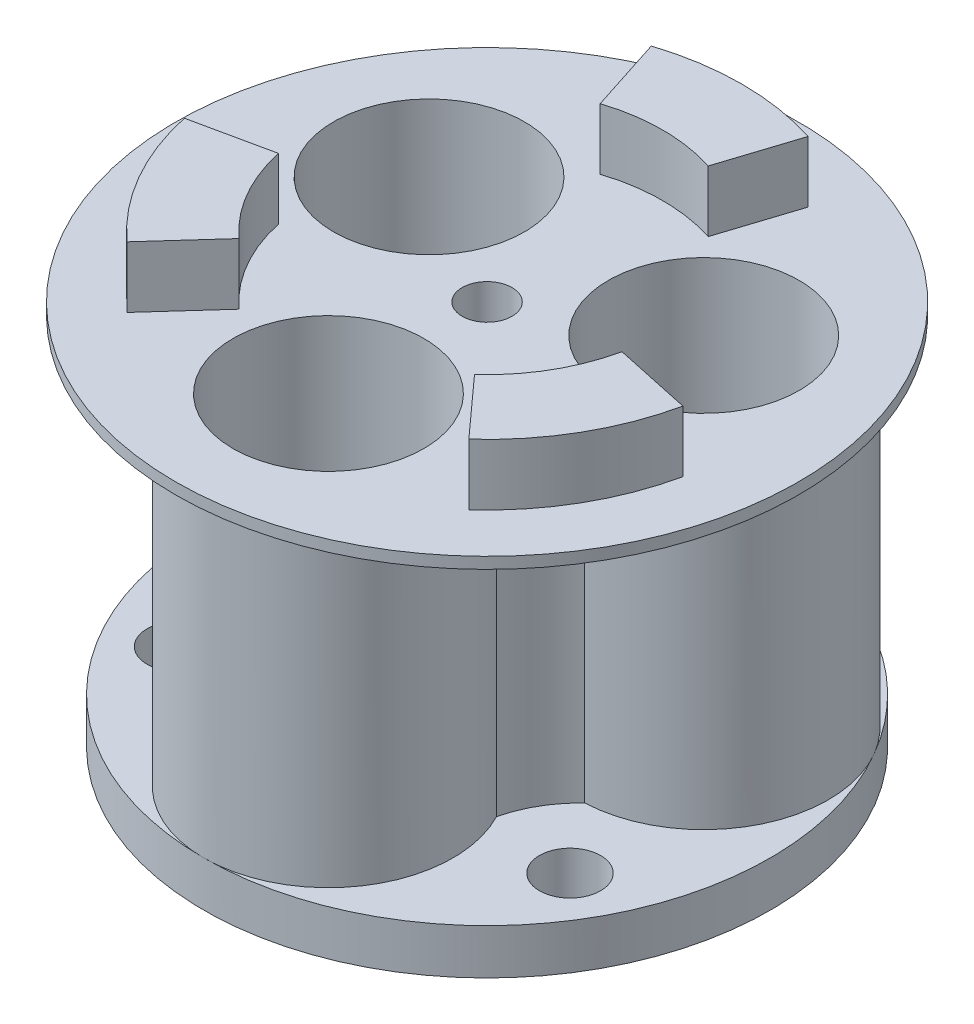
ISO-10303-21;
HEADER;
FILE_DESCRIPTION(('STEP AP214'),'2;1');
FILE_NAME('part.step','',(''),(''),'','','');
FILE_SCHEMA(('AUTOMOTIVE_DESIGN { 1 0 10303 214 1 1 1 1 }'));
ENDSEC;
DATA;
#1=APPLICATION_CONTEXT('core data for automotive mechanical design processes');
#2=APPLICATION_PROTOCOL_DEFINITION('international standard','automotive_design',2000,#1);
#3=PRODUCT_CONTEXT('',#1,'mechanical');
#4=PRODUCT('Part','Part','',(#3));
#5=PRODUCT_RELATED_PRODUCT_CATEGORY('part','',(#4));
#6=PRODUCT_DEFINITION_FORMATION('','',#4);
#7=PRODUCT_DEFINITION_CONTEXT('part definition',#1,'design');
#8=PRODUCT_DEFINITION('design','',#6,#7);
#9=PRODUCT_DEFINITION_SHAPE('','',#8);
#10=(LENGTH_UNIT() NAMED_UNIT(*) SI_UNIT(.MILLI.,.METRE.));
#11=(NAMED_UNIT(*) PLANE_ANGLE_UNIT() SI_UNIT($,.RADIAN.));
#12=(NAMED_UNIT(*) SI_UNIT($,.STERADIAN.) SOLID_ANGLE_UNIT());
#13=UNCERTAINTY_MEASURE_WITH_UNIT(LENGTH_MEASURE(1.E-05),#10,'distance_accuracy_value','');
#14=(GEOMETRIC_REPRESENTATION_CONTEXT(3) GLOBAL_UNCERTAINTY_ASSIGNED_CONTEXT((#13)) GLOBAL_UNIT_ASSIGNED_CONTEXT((#10,
#11,#12)) REPRESENTATION_CONTEXT('',''));
#15=CARTESIAN_POINT('',(0.,0.,0.));
#16=DIRECTION('',(0.,0.,1.));
#17=DIRECTION('',(1.,0.,0.));
#18=AXIS2_PLACEMENT_3D('',#15,#16,#17);
#19=CARTESIAN_POINT('',(0.,0.,0.));
#20=DIRECTION('',(0.,1.,0.));
#21=DIRECTION('',(0.,0.,1.));
#22=AXIS2_PLACEMENT_3D('',#19,#20,#21);
#23=PLANE('',#22);
#24=CARTESIAN_POINT('',(12.1243556529822,0.,-6.99999999999989));
#25=DIRECTION('',(0.,1.,0.));
#26=DIRECTION('',(0.,0.,1.));
#27=AXIS2_PLACEMENT_3D('',#24,#25,#26);
#28=CIRCLE('',#27,8.425);
#29=CARTESIAN_POINT('',(12.1243556529822,0.,1.42500000000011));
#30=VERTEX_POINT('',#29);
#31=EDGE_CURVE('E367',#30,#30,#28,.T.);
#32=ORIENTED_EDGE('',*,*,#31,.T.);
#33=EDGE_LOOP('',(#32));
#34=FACE_BOUND('',#33,.T.);
#35=CARTESIAN_POINT('',(-12.1243556529821,0.,-7.00000000000006));
#36=DIRECTION('',(0.,1.,0.));
#37=DIRECTION('',(0.,0.,1.));
#38=AXIS2_PLACEMENT_3D('',#35,#36,#37);
#39=CIRCLE('',#38,8.425);
#40=CARTESIAN_POINT('',(-12.1243556529821,0.,1.42499999999994));
#41=VERTEX_POINT('',#40);
#42=EDGE_CURVE('E372',#41,#41,#39,.T.);
#43=ORIENTED_EDGE('',*,*,#42,.T.);
#44=EDGE_LOOP('',(#43));
#45=FACE_BOUND('',#44,.T.);
#46=CARTESIAN_POINT('',(0.,0.,14.));
#47=DIRECTION('',(0.,1.,0.));
#48=DIRECTION('',(0.,0.,1.));
#49=AXIS2_PLACEMENT_3D('',#46,#47,#48);
#50=CIRCLE('',#49,8.425);
#51=CARTESIAN_POINT('',(0.,0.,22.425));
#52=VERTEX_POINT('',#51);
#53=EDGE_CURVE('E380',#52,#52,#50,.T.);
#54=ORIENTED_EDGE('',*,*,#53,.T.);
#55=EDGE_LOOP('',(#54));
#56=FACE_BOUND('',#55,.T.);
#57=CARTESIAN_POINT('',(0.,0.,0.));
#58=DIRECTION('',(0.,1.,0.));
#59=DIRECTION('',(0.,0.,1.));
#60=AXIS2_PLACEMENT_3D('',#57,#58,#59);
#61=CIRCLE('',#60,2.2);
#62=CARTESIAN_POINT('',(0.,0.,2.2));
#63=VERTEX_POINT('',#62);
#64=EDGE_CURVE('E388',#63,#63,#61,.T.);
#65=ORIENTED_EDGE('',*,*,#64,.T.);
#66=EDGE_LOOP('',(#65));
#67=FACE_BOUND('',#66,.T.);
#68=CARTESIAN_POINT('',(17.3205080756888,0.,10.));
#69=DIRECTION('',(0.,-1.,0.));
#70=DIRECTION('',(0.,0.,-1.));
#71=AXIS2_PLACEMENT_3D('',#68,#69,#70);
#72=CIRCLE('',#71,2.7);
#73=CARTESIAN_POINT('',(17.3205080756888,0.,7.30000000000001));
#74=VERTEX_POINT('',#73);
#75=EDGE_CURVE('E197',#74,#74,#72,.T.);
#76=ORIENTED_EDGE('',*,*,#75,.F.);
#77=EDGE_LOOP('',(#76));
#78=FACE_BOUND('',#77,.T.);
#79=CARTESIAN_POINT('',(-17.3205080756888,0.,10.));
#80=DIRECTION('',(0.,-1.,0.));
#81=DIRECTION('',(0.,0.,-1.));
#82=AXIS2_PLACEMENT_3D('',#79,#80,#81);
#83=CIRCLE('',#82,2.7);
#84=CARTESIAN_POINT('',(-17.3205080756888,0.,7.3));
#85=VERTEX_POINT('',#84);
#86=EDGE_CURVE('E867',#85,#85,#83,.T.);
#87=ORIENTED_EDGE('',*,*,#86,.F.);
#88=EDGE_LOOP('',(#87));
#89=FACE_BOUND('',#88,.T.);
#90=CARTESIAN_POINT('',(0.,0.,-20.));
#91=DIRECTION('',(0.,-1.,0.));
#92=DIRECTION('',(0.,0.,-1.));
#93=AXIS2_PLACEMENT_3D('',#90,#91,#92);
#94=CIRCLE('',#93,2.7);
#95=CARTESIAN_POINT('',(0.,0.,-22.7));
#96=VERTEX_POINT('',#95);
#97=EDGE_CURVE('E405',#96,#96,#94,.T.);
#98=ORIENTED_EDGE('',*,*,#97,.F.);
#99=EDGE_LOOP('',(#98));
#100=FACE_BOUND('',#99,.T.);
#101=CARTESIAN_POINT('',(0.,0.,0.));
#102=DIRECTION('',(0.,-1.,0.));
#103=DIRECTION('',(0.,0.,-1.));
#104=AXIS2_PLACEMENT_3D('',#101,#102,#103);
#105=CIRCLE('',#104,25.);
#106=CARTESIAN_POINT('',(0.,0.,-25.));
#107=VERTEX_POINT('',#106);
#108=EDGE_CURVE('E185',#107,#107,#105,.T.);
#109=ORIENTED_EDGE('',*,*,#108,.T.);
#110=EDGE_LOOP('',(#109));
#111=FACE_BOUND('',#110,.T.);
#112=ADVANCED_FACE('F41',(#34,#45,#56,#67,#78,#89,#100,#111),#23,.F.);
#113=CARTESIAN_POINT('',(0.,4.,0.));
#114=DIRECTION('',(0.,1.,0.));
#115=DIRECTION('',(0.,0.,1.));
#116=AXIS2_PLACEMENT_3D('',#113,#114,#115);
#117=PLANE('',#116);
#118=CARTESIAN_POINT('',(17.3205080756888,4.,10.));
#119=DIRECTION('',(0.,1.,0.));
#120=DIRECTION('',(0.,0.,1.));
#121=AXIS2_PLACEMENT_3D('',#118,#119,#120);
#122=CIRCLE('',#121,2.7);
#123=CARTESIAN_POINT('',(17.3205080756888,4.,12.7));
#124=VERTEX_POINT('',#123);
#125=EDGE_CURVE('E401',#124,#124,#122,.T.);
#126=ORIENTED_EDGE('',*,*,#125,.F.);
#127=EDGE_LOOP('',(#126));
#128=FACE_BOUND('',#127,.T.);
#129=CARTESIAN_POINT('',(1.42649182304901E-12,4.,13.9999999999991));
#130=DIRECTION('',(0.,1.,0.));
#131=DIRECTION('',(0.,0.,1.));
#132=AXIS2_PLACEMENT_3D('',#129,#130,#131);
#133=CIRCLE('',#132,11.);
#134=CARTESIAN_POINT('',(2.5473068268733E-12,4.,24.9999999999991));
#135=VERTEX_POINT('',#134);
#136=CARTESIAN_POINT('',(9.75951782142741,4.,8.92537568944486));
#137=VERTEX_POINT('',#136);
#138=EDGE_CURVE('E194',#135,#137,#133,.T.);
#139=ORIENTED_EDGE('',*,*,#138,.F.);
#140=CARTESIAN_POINT('',(0.,4.,0.));
#141=DIRECTION('',(0.,-1.,0.));
#142=DIRECTION('',(0.,0.,-1.));
#143=AXIS2_PLACEMENT_3D('',#140,#141,#142);
#144=CIRCLE('',#143,25.);
#145=CARTESIAN_POINT('',(21.6506350946097,4.,-12.5000000000022));
#146=VERTEX_POINT('',#145);
#147=EDGE_CURVE('E59',#146,#135,#144,.T.);
#148=ORIENTED_EDGE('',*,*,#147,.F.);
#149=CARTESIAN_POINT('',(12.1243556529822,4.,-7.00000000000166));
#150=DIRECTION('',(0.,1.,0.));
#151=DIRECTION('',(0.,0.,1.));
#152=AXIS2_PLACEMENT_3D('',#149,#150,#151);
#153=CIRCLE('',#152,11.);
#154=CARTESIAN_POINT('',(12.6093609960954,4.,3.98930251731724));
#155=VERTEX_POINT('',#154);
#156=EDGE_CURVE('E193',#155,#146,#153,.T.);
#157=ORIENTED_EDGE('',*,*,#156,.F.);
#158=CARTESIAN_POINT('',(19.4855715851499,4.,11.2499999999983));
#159=DIRECTION('',(0.,1.,0.));
#160=DIRECTION('',(0.,0.,1.));
#161=AXIS2_PLACEMENT_3D('',#158,#159,#160);
#162=CIRCLE('',#161,10.0000000000018);
#163=EDGE_CURVE('E213',#155,#137,#162,.T.);
#164=ORIENTED_EDGE('',*,*,#163,.T.);
#165=EDGE_LOOP('',(#139,#148,#157,#164));
#166=FACE_BOUND('',#165,.T.);
#167=ADVANCED_FACE('F190',(#128,#166),#117,.T.);
#168=CARTESIAN_POINT('',(0.,4.,-20.));
#169=DIRECTION('',(0.,1.,0.));
#170=DIRECTION('',(0.,0.,1.));
#171=AXIS2_PLACEMENT_3D('',#168,#169,#170);
#172=CIRCLE('',#171,2.7);
#173=CARTESIAN_POINT('',(0.,4.,-17.3));
#174=VERTEX_POINT('',#173);
#175=EDGE_CURVE('E45',#174,#174,#172,.T.);
#176=ORIENTED_EDGE('',*,*,#175,.F.);
#177=EDGE_LOOP('',(#176));
#178=FACE_BOUND('',#177,.T.);
#179=CARTESIAN_POINT('',(2.84984317466854,4.,-12.9146782067687));
#180=VERTEX_POINT('',#179);
#181=EDGE_CURVE('E199',#146,#180,#153,.T.);
#182=ORIENTED_EDGE('',*,*,#181,.F.);
#183=CARTESIAN_POINT('',(-21.6506350946109,4.,-12.5000000000001));
#184=VERTEX_POINT('',#183);
#185=EDGE_CURVE('E176',#184,#146,#144,.T.);
#186=ORIENTED_EDGE('',*,*,#185,.F.);
#187=CARTESIAN_POINT('',(-12.1243556529821,4.,-7.00000000000006));
#188=DIRECTION('',(0.,1.,0.));
#189=DIRECTION('',(0.,0.,1.));
#190=AXIS2_PLACEMENT_3D('',#187,#188,#189);
#191=CIRCLE('',#190,11.);
#192=CARTESIAN_POINT('',(-2.84984317466973,4.,-12.914678206769));
#193=VERTEX_POINT('',#192);
#194=EDGE_CURVE('E427',#193,#184,#191,.T.);
#195=ORIENTED_EDGE('',*,*,#194,.F.);
#196=CARTESIAN_POINT('',(0.,4.,-22.5));
#197=DIRECTION('',(0.,1.,0.));
#198=DIRECTION('',(0.,0.,1.));
#199=AXIS2_PLACEMENT_3D('',#196,#197,#198);
#200=CIRCLE('',#199,10.);
#201=EDGE_CURVE('E202',#193,#180,#200,.T.);
#202=ORIENTED_EDGE('',*,*,#201,.T.);
#203=EDGE_LOOP('',(#182,#186,#195,#202));
#204=FACE_BOUND('',#203,.T.);
#205=ADVANCED_FACE('F200',(#178,#204),#117,.T.);
#206=CARTESIAN_POINT('',(-17.3205080756888,4.,10.));
#207=DIRECTION('',(0.,1.,0.));
#208=DIRECTION('',(0.,0.,1.));
#209=AXIS2_PLACEMENT_3D('',#206,#207,#208);
#210=CIRCLE('',#209,2.7);
#211=CARTESIAN_POINT('',(-17.3205080756888,4.,12.7));
#212=VERTEX_POINT('',#211);
#213=EDGE_CURVE('E404',#212,#212,#210,.T.);
#214=ORIENTED_EDGE('',*,*,#213,.F.);
#215=EDGE_LOOP('',(#214));
#216=FACE_BOUND('',#215,.T.);
#217=CARTESIAN_POINT('',(-12.6093609960946,4.,3.98930251731888));
#218=VERTEX_POINT('',#217);
#219=EDGE_CURVE('E426',#184,#218,#191,.T.);
#220=ORIENTED_EDGE('',*,*,#219,.F.);
#221=EDGE_CURVE('E179',#135,#184,#144,.T.);
#222=ORIENTED_EDGE('',*,*,#221,.F.);
#223=CARTESIAN_POINT('',(-9.75951782142639,4.,8.92537568944838));
#224=VERTEX_POINT('',#223);
#225=EDGE_CURVE('E415',#224,#135,#133,.T.);
#226=ORIENTED_EDGE('',*,*,#225,.F.);
#227=CARTESIAN_POINT('',(-19.4855715851484,4.,11.2499999999992));
#228=DIRECTION('',(0.,1.,0.));
#229=DIRECTION('',(0.,0.,1.));
#230=AXIS2_PLACEMENT_3D('',#227,#228,#229);
#231=CIRCLE('',#230,10.0000000000007);
#232=EDGE_CURVE('E420',#224,#218,#231,.T.);
#233=ORIENTED_EDGE('',*,*,#232,.T.);
#234=EDGE_LOOP('',(#220,#222,#226,#233));
#235=FACE_BOUND('',#234,.T.);
#236=ADVANCED_FACE('F444',(#216,#235),#117,.T.);
#237=CARTESIAN_POINT('',(0.,34.,0.));
#238=DIRECTION('',(0.,1.,0.));
#239=DIRECTION('',(0.,0.,1.));
#240=AXIS2_PLACEMENT_3D('',#237,#238,#239);
#241=PLANE('',#240);
#242=CARTESIAN_POINT('',(0.,34.,0.));
#243=DIRECTION('',(0.,1.,0.));
#244=DIRECTION('',(0.,0.,1.));
#245=AXIS2_PLACEMENT_3D('',#242,#243,#244);
#246=CIRCLE('',#245,15.5);
#247=CARTESIAN_POINT('',(4.76402757589708,34.,-14.7497132601313));
#248=VERTEX_POINT('',#247);
#249=CARTESIAN_POINT('',(-4.76402757589696,34.,-14.7497132601313));
#250=VERTEX_POINT('',#249);
#251=EDGE_CURVE('E283',#248,#250,#246,.T.);
#252=ORIENTED_EDGE('',*,*,#251,.T.);
#253=DIRECTION('',(0.307356617799804,0.,0.951594403879439));
#254=VECTOR('',#253,1.);
#255=CARTESIAN_POINT('',(0.,34.,0.));
#256=LINE('',#255,#254);
#257=CARTESIAN_POINT('',(-6.91552390049559,34.,-21.4108740872874));
#258=VERTEX_POINT('',#257);
#259=EDGE_CURVE('E289',#258,#250,#256,.T.);
#260=ORIENTED_EDGE('',*,*,#259,.F.);
#261=CARTESIAN_POINT('',(0.,34.,0.));
#262=DIRECTION('',(0.,1.,0.));
#263=DIRECTION('',(0.,0.,1.));
#264=AXIS2_PLACEMENT_3D('',#261,#262,#263);
#265=CIRCLE('',#264,22.5);
#266=CARTESIAN_POINT('',(6.91552390049576,34.,-21.4108740872873));
#267=VERTEX_POINT('',#266);
#268=EDGE_CURVE('E307',#267,#258,#265,.T.);
#269=ORIENTED_EDGE('',*,*,#268,.F.);
#270=DIRECTION('',(-0.307356617799811,0.,0.951594403879437));
#271=VECTOR('',#270,1.);
#272=CARTESIAN_POINT('',(0.,34.,0.));
#273=LINE('',#272,#271);
#274=EDGE_CURVE('E303',#267,#248,#273,.T.);
#275=ORIENTED_EDGE('',*,*,#274,.T.);
#276=EDGE_LOOP('',(#252,#260,#269,#275));
#277=FACE_BOUND('',#276,.T.);
#278=CARTESIAN_POINT('',(0.,34.,0.));
#279=DIRECTION('',(0.,1.,0.));
#280=DIRECTION('',(0.,0.,1.));
#281=AXIS2_PLACEMENT_3D('',#278,#279,#280);
#282=CIRCLE('',#281,15.5);
#283=CARTESIAN_POINT('',(-15.1556401697584,34.,3.24908772500916));
#284=VERTEX_POINT('',#283);
#285=CARTESIAN_POINT('',(-10.3916125938614,34.,11.500625535122));
#286=VERTEX_POINT('',#285);
#287=EDGE_CURVE('E325',#284,#286,#282,.T.);
#288=ORIENTED_EDGE('',*,*,#287,.T.);
#289=DIRECTION('',(0.670426618958802,0.,-0.741975840975614));
#290=VECTOR('',#289,1.);
#291=CARTESIAN_POINT('',(0.,34.,0.));
#292=LINE('',#291,#290);
#293=CARTESIAN_POINT('',(-15.0845989265731,34.,16.6944564219513));
#294=VERTEX_POINT('',#293);
#295=EDGE_CURVE('E331',#294,#286,#292,.T.);
#296=ORIENTED_EDGE('',*,*,#295,.F.);
#297=CARTESIAN_POINT('',(0.,34.,0.));
#298=DIRECTION('',(0.,1.,0.));
#299=DIRECTION('',(0.,0.,1.));
#300=AXIS2_PLACEMENT_3D('',#297,#298,#299);
#301=CIRCLE('',#300,22.5);
#302=CARTESIAN_POINT('',(-22.0001228270687,34.,4.71641766533588));
#303=VERTEX_POINT('',#302);
#304=EDGE_CURVE('E349',#303,#294,#301,.T.);
#305=ORIENTED_EDGE('',*,*,#304,.F.);
#306=DIRECTION('',(0.977783236758607,0.,-0.209618562903818));
#307=VECTOR('',#306,1.);
#308=CARTESIAN_POINT('',(0.,34.,0.));
#309=LINE('',#308,#307);
#310=EDGE_CURVE('E345',#303,#284,#309,.T.);
#311=ORIENTED_EDGE('',*,*,#310,.T.);
#312=EDGE_LOOP('',(#288,#296,#305,#311));
#313=FACE_BOUND('',#312,.T.);
#314=CARTESIAN_POINT('',(-12.1243556529821,34.,-7.00000000000006));
#315=DIRECTION('',(0.,1.,0.));
#316=DIRECTION('',(0.,0.,1.));
#317=AXIS2_PLACEMENT_3D('',#314,#315,#316);
#318=CIRCLE('',#317,8.425);
#319=CARTESIAN_POINT('',(-12.1243556529821,34.,1.42499999999994));
#320=VERTEX_POINT('',#319);
#321=EDGE_CURVE('E376',#320,#320,#318,.T.);
#322=ORIENTED_EDGE('',*,*,#321,.F.);
#323=EDGE_LOOP('',(#322));
#324=FACE_BOUND('',#323,.T.);
#325=CARTESIAN_POINT('',(0.,34.,0.));
#326=DIRECTION('',(0.,1.,0.));
#327=DIRECTION('',(0.,0.,1.));
#328=AXIS2_PLACEMENT_3D('',#325,#326,#327);
#329=CIRCLE('',#328,2.2);
#330=CARTESIAN_POINT('',(0.,34.,2.2));
#331=VERTEX_POINT('',#330);
#332=EDGE_CURVE('E51',#331,#331,#329,.T.);
#333=ORIENTED_EDGE('',*,*,#332,.F.);
#334=EDGE_LOOP('',(#333));
#335=FACE_BOUND('',#334,.T.);
#336=CARTESIAN_POINT('',(0.,34.,0.));
#337=DIRECTION('',(0.,1.,0.));
#338=DIRECTION('',(0.,0.,1.));
#339=AXIS2_PLACEMENT_3D('',#336,#337,#338);
#340=CIRCLE('',#339,27.5);
#341=CARTESIAN_POINT('',(0.,34.,27.5));
#342=VERTEX_POINT('',#341);
#343=EDGE_CURVE('E11',#342,#342,#340,.T.);
#344=ORIENTED_EDGE('',*,*,#343,.T.);
#345=EDGE_LOOP('',(#344));
#346=FACE_BOUND('',#345,.T.);
#347=CARTESIAN_POINT('',(0.,34.,14.));
#348=DIRECTION('',(0.,1.,0.));
#349=DIRECTION('',(0.,0.,1.));
#350=AXIS2_PLACEMENT_3D('',#347,#348,#349);
#351=CIRCLE('',#350,8.425);
#352=CARTESIAN_POINT('',(0.,34.,22.425));
#353=VERTEX_POINT('',#352);
#354=EDGE_CURVE('E384',#353,#353,#351,.T.);
#355=ORIENTED_EDGE('',*,*,#354,.F.);
#356=EDGE_LOOP('',(#355));
#357=FACE_BOUND('',#356,.T.);
#358=CARTESIAN_POINT('',(12.1243556529822,34.,-6.99999999999989));
#359=DIRECTION('',(0.,1.,0.));
#360=DIRECTION('',(0.,0.,1.));
#361=AXIS2_PLACEMENT_3D('',#358,#359,#360);
#362=CIRCLE('',#361,8.425);
#363=CARTESIAN_POINT('',(12.1243556529822,34.,1.42500000000011));
#364=VERTEX_POINT('',#363);
#365=EDGE_CURVE('E368',#364,#364,#362,.T.);
#366=ORIENTED_EDGE('',*,*,#365,.F.);
#367=EDGE_LOOP('',(#366));
#368=FACE_BOUND('',#367,.T.);
#369=DIRECTION('',(-0.977783236758605,0.,-0.209618562903826));
#370=VECTOR('',#369,1.);
#371=CARTESIAN_POINT('',(0.,34.,0.));
#372=LINE('',#371,#370);
#373=CARTESIAN_POINT('',(22.0001228270686,34.,4.71641766533608));
#374=VERTEX_POINT('',#373);
#375=CARTESIAN_POINT('',(15.1556401697584,34.,3.2490877250093));
#376=VERTEX_POINT('',#375);
#377=EDGE_CURVE('E67',#374,#376,#372,.T.);
#378=ORIENTED_EDGE('',*,*,#377,.F.);
#379=CARTESIAN_POINT('',(0.,34.,0.));
#380=DIRECTION('',(0.,1.,0.));
#381=DIRECTION('',(0.,0.,1.));
#382=AXIS2_PLACEMENT_3D('',#379,#380,#381);
#383=CIRCLE('',#382,22.5);
#384=CARTESIAN_POINT('',(15.0845989265729,34.,16.6944564219515));
#385=VERTEX_POINT('',#384);
#386=EDGE_CURVE('E258',#385,#374,#383,.T.);
#387=ORIENTED_EDGE('',*,*,#386,.F.);
#388=DIRECTION('',(-0.670426618958796,0.,-0.74197584097562));
#389=VECTOR('',#388,1.);
#390=CARTESIAN_POINT('',(0.,34.,0.));
#391=LINE('',#390,#389);
#392=CARTESIAN_POINT('',(10.3916125938613,34.,11.5006255351221));
#393=VERTEX_POINT('',#392);
#394=EDGE_CURVE('E246',#385,#393,#391,.T.);
#395=ORIENTED_EDGE('',*,*,#394,.T.);
#396=CARTESIAN_POINT('',(0.,34.,0.));
#397=DIRECTION('',(0.,1.,0.));
#398=DIRECTION('',(0.,0.,1.));
#399=AXIS2_PLACEMENT_3D('',#396,#397,#398);
#400=CIRCLE('',#399,15.5);
#401=EDGE_CURVE('E264',#393,#376,#400,.T.);
#402=ORIENTED_EDGE('',*,*,#401,.T.);
#403=EDGE_LOOP('',(#378,#387,#395,#402));
#404=FACE_BOUND('',#403,.T.);
#405=ADVANCED_FACE('F489',(#277,#313,#324,#335,#346,#357,#368,#404),#241,.T.);
#406=CARTESIAN_POINT('',(0.,34.,0.));
#407=DIRECTION('',(0.,-1.,0.));
#408=DIRECTION('',(0.,0.,-1.));
#409=AXIS2_PLACEMENT_3D('',#406,#407,#408);
#410=CYLINDRICAL_SURFACE('',#409,27.5);
#411=CARTESIAN_POINT('',(0.,33.,0.));
#412=DIRECTION('',(0.,1.,0.));
#413=DIRECTION('',(0.,0.,1.));
#414=AXIS2_PLACEMENT_3D('',#411,#412,#413);
#415=CIRCLE('',#414,27.5);
#416=CARTESIAN_POINT('',(0.,33.,27.5));
#417=VERTEX_POINT('',#416);
#418=EDGE_CURVE('E240',#417,#417,#415,.T.);
#419=ORIENTED_EDGE('',*,*,#418,.T.);
#420=EDGE_LOOP('',(#419));
#421=FACE_BOUND('',#420,.T.);
#422=ORIENTED_EDGE('',*,*,#343,.F.);
#423=EDGE_LOOP('',(#422));
#424=FACE_BOUND('',#423,.T.);
#425=ADVANCED_FACE('F43',(#421,#424),#410,.T.);
#426=CARTESIAN_POINT('',(0.,34.,0.));
#427=DIRECTION('',(0.,-1.,0.));
#428=DIRECTION('',(0.,0.,-1.));
#429=AXIS2_PLACEMENT_3D('',#426,#427,#428);
#430=CYLINDRICAL_SURFACE('',#429,2.2);
#431=ORIENTED_EDGE('',*,*,#332,.T.);
#432=EDGE_LOOP('',(#431));
#433=FACE_BOUND('',#432,.T.);
#434=ORIENTED_EDGE('',*,*,#64,.F.);
#435=EDGE_LOOP('',(#434));
#436=FACE_BOUND('',#435,.T.);
#437=ADVANCED_FACE('F493',(#433,#436),#430,.F.);
#438=CARTESIAN_POINT('',(0.,34.,14.));
#439=DIRECTION('',(0.,-1.,0.));
#440=DIRECTION('',(0.,0.,-1.));
#441=AXIS2_PLACEMENT_3D('',#438,#439,#440);
#442=CYLINDRICAL_SURFACE('',#441,8.425);
#443=ORIENTED_EDGE('',*,*,#354,.T.);
#444=EDGE_LOOP('',(#443));
#445=FACE_BOUND('',#444,.T.);
#446=ORIENTED_EDGE('',*,*,#53,.F.);
#447=EDGE_LOOP('',(#446));
#448=FACE_BOUND('',#447,.T.);
#449=ADVANCED_FACE('F496',(#445,#448),#442,.F.);
#450=CARTESIAN_POINT('',(-12.1243556529821,34.,-7.00000000000006));
#451=DIRECTION('',(0.,-1.,0.));
#452=DIRECTION('',(0.,0.,-1.));
#453=AXIS2_PLACEMENT_3D('',#450,#451,#452);
#454=CYLINDRICAL_SURFACE('',#453,8.425);
#455=ORIENTED_EDGE('',*,*,#321,.T.);
#456=EDGE_LOOP('',(#455));
#457=FACE_BOUND('',#456,.T.);
#458=ORIENTED_EDGE('',*,*,#42,.F.);
#459=EDGE_LOOP('',(#458));
#460=FACE_BOUND('',#459,.T.);
#461=ADVANCED_FACE('F500',(#457,#460),#454,.F.);
#462=CARTESIAN_POINT('',(12.1243556529822,34.,-6.99999999999989));
#463=DIRECTION('',(0.,-1.,0.));
#464=DIRECTION('',(0.,0.,-1.));
#465=AXIS2_PLACEMENT_3D('',#462,#463,#464);
#466=CYLINDRICAL_SURFACE('',#465,8.425);
#467=ORIENTED_EDGE('',*,*,#365,.T.);
#468=EDGE_LOOP('',(#467));
#469=FACE_BOUND('',#468,.T.);
#470=ORIENTED_EDGE('',*,*,#31,.F.);
#471=EDGE_LOOP('',(#470));
#472=FACE_BOUND('',#471,.T.);
#473=ADVANCED_FACE('F504',(#469,#472),#466,.F.);
#474=CARTESIAN_POINT('',(0.,39.4,0.));
#475=DIRECTION('',(0.,-1.,0.));
#476=DIRECTION('',(0.,0.,-1.));
#477=AXIS2_PLACEMENT_3D('',#474,#475,#476);
#478=CYLINDRICAL_SURFACE('',#477,15.5);
#479=ORIENTED_EDGE('',*,*,#287,.F.);
#480=DIRECTION('',(0.,-1.,0.));
#481=VECTOR('',#480,1.);
#482=CARTESIAN_POINT('',(-15.1556401697584,39.4,3.24908772500916));
#483=LINE('',#482,#481);
#484=CARTESIAN_POINT('',(-15.1556401697584,39.4,3.24908772500916));
#485=VERTEX_POINT('',#484);
#486=EDGE_CURVE('E364',#485,#284,#483,.T.);
#487=ORIENTED_EDGE('',*,*,#486,.F.);
#488=CARTESIAN_POINT('',(0.,39.4,0.));
#489=DIRECTION('',(0.,1.,0.));
#490=DIRECTION('',(0.,0.,1.));
#491=AXIS2_PLACEMENT_3D('',#488,#489,#490);
#492=CIRCLE('',#491,15.5);
#493=CARTESIAN_POINT('',(-10.3916125938614,39.4,11.500625535122));
#494=VERTEX_POINT('',#493);
#495=EDGE_CURVE('E326',#485,#494,#492,.T.);
#496=ORIENTED_EDGE('',*,*,#495,.T.);
#497=DIRECTION('',(0.,-1.,0.));
#498=VECTOR('',#497,1.);
#499=CARTESIAN_POINT('',(-10.3916125938614,39.4,11.500625535122));
#500=LINE('',#499,#498);
#501=EDGE_CURVE('E341',#494,#286,#500,.T.);
#502=ORIENTED_EDGE('',*,*,#501,.T.);
#503=EDGE_LOOP('',(#479,#487,#496,#502));
#504=FACE_BOUND('',#503,.T.);
#505=ADVANCED_FACE('F508',(#504),#478,.F.);
#506=CARTESIAN_POINT('',(0.,39.4,0.));
#507=DIRECTION('',(-0.209618562903818,0.,-0.977783236758607));
#508=DIRECTION('',(-0.977783236758607,0.,0.209618562903818));
#509=AXIS2_PLACEMENT_3D('',#506,#507,#508);
#510=PLANE('',#509);
#511=ORIENTED_EDGE('',*,*,#310,.F.);
#512=DIRECTION('',(0.,-1.,0.));
#513=VECTOR('',#512,1.);
#514=CARTESIAN_POINT('',(-22.0001228270687,39.4,4.71641766533588));
#515=LINE('',#514,#513);
#516=CARTESIAN_POINT('',(-22.0001228270687,39.4,4.71641766533588));
#517=VERTEX_POINT('',#516);
#518=EDGE_CURVE('E361',#517,#303,#515,.T.);
#519=ORIENTED_EDGE('',*,*,#518,.F.);
#520=DIRECTION('',(0.977783236758607,0.,-0.209618562903818));
#521=VECTOR('',#520,1.);
#522=CARTESIAN_POINT('',(0.,39.4,0.));
#523=LINE('',#522,#521);
#524=EDGE_CURVE('E330',#517,#485,#523,.T.);
#525=ORIENTED_EDGE('',*,*,#524,.T.);
#526=ORIENTED_EDGE('',*,*,#486,.T.);
#527=EDGE_LOOP('',(#511,#519,#525,#526));
#528=FACE_BOUND('',#527,.T.);
#529=ADVANCED_FACE('F512',(#528),#510,.T.);
#530=CARTESIAN_POINT('',(0.,39.4,0.));
#531=DIRECTION('',(0.,-1.,0.));
#532=DIRECTION('',(0.,0.,-1.));
#533=AXIS2_PLACEMENT_3D('',#530,#531,#532);
#534=CYLINDRICAL_SURFACE('',#533,22.5);
#535=ORIENTED_EDGE('',*,*,#304,.T.);
#536=DIRECTION('',(0.,-1.,0.));
#537=VECTOR('',#536,1.);
#538=CARTESIAN_POINT('',(-15.084598926573,39.4,16.6944564219513));
#539=LINE('',#538,#537);
#540=CARTESIAN_POINT('',(-15.084598926573,39.4,16.6944564219513));
#541=VERTEX_POINT('',#540);
#542=EDGE_CURVE('E358',#541,#294,#539,.T.);
#543=ORIENTED_EDGE('',*,*,#542,.F.);
#544=CARTESIAN_POINT('',(0.,39.4,0.));
#545=DIRECTION('',(0.,1.,0.));
#546=DIRECTION('',(0.,0.,1.));
#547=AXIS2_PLACEMENT_3D('',#544,#545,#546);
#548=CIRCLE('',#547,22.5);
#549=EDGE_CURVE('E335',#517,#541,#548,.T.);
#550=ORIENTED_EDGE('',*,*,#549,.F.);
#551=ORIENTED_EDGE('',*,*,#518,.T.);
#552=EDGE_LOOP('',(#535,#543,#550,#551));
#553=FACE_BOUND('',#552,.T.);
#554=ADVANCED_FACE('F516',(#553),#534,.T.);
#555=CARTESIAN_POINT('',(0.,39.4,0.));
#556=DIRECTION('',(-0.741975840975614,0.,-0.670426618958802));
#557=DIRECTION('',(-0.670426618958802,0.,0.741975840975614));
#558=AXIS2_PLACEMENT_3D('',#555,#556,#557);
#559=PLANE('',#558);
#560=ORIENTED_EDGE('',*,*,#295,.T.);
#561=ORIENTED_EDGE('',*,*,#501,.F.);
#562=DIRECTION('',(0.670426618958802,0.,-0.741975840975614));
#563=VECTOR('',#562,1.);
#564=CARTESIAN_POINT('',(0.,39.4,0.));
#565=LINE('',#564,#563);
#566=EDGE_CURVE('E338',#541,#494,#565,.T.);
#567=ORIENTED_EDGE('',*,*,#566,.F.);
#568=ORIENTED_EDGE('',*,*,#542,.T.);
#569=EDGE_LOOP('',(#560,#561,#567,#568));
#570=FACE_BOUND('',#569,.T.);
#571=ADVANCED_FACE('F520',(#570),#559,.F.);
#572=CARTESIAN_POINT('',(0.,39.4,0.));
#573=DIRECTION('',(0.,1.,0.));
#574=DIRECTION('',(0.,0.,1.));
#575=AXIS2_PLACEMENT_3D('',#572,#573,#574);
#576=PLANE('',#575);
#577=ORIENTED_EDGE('',*,*,#495,.F.);
#578=ORIENTED_EDGE('',*,*,#524,.F.);
#579=ORIENTED_EDGE('',*,*,#549,.T.);
#580=ORIENTED_EDGE('',*,*,#566,.T.);
#581=EDGE_LOOP('',(#577,#578,#579,#580));
#582=FACE_BOUND('',#581,.T.);
#583=ADVANCED_FACE('F524',(#582),#576,.T.);
#584=CARTESIAN_POINT('',(0.,39.4,0.));
#585=DIRECTION('',(0.,-1.,0.));
#586=DIRECTION('',(0.,0.,-1.));
#587=AXIS2_PLACEMENT_3D('',#584,#585,#586);
#588=CYLINDRICAL_SURFACE('',#587,15.5);
#589=ORIENTED_EDGE('',*,*,#251,.F.);
#590=DIRECTION('',(0.,-1.,0.));
#591=VECTOR('',#590,1.);
#592=CARTESIAN_POINT('',(4.76402757589708,39.4,-14.7497132601313));
#593=LINE('',#592,#591);
#594=CARTESIAN_POINT('',(4.76402757589708,39.4,-14.7497132601313));
#595=VERTEX_POINT('',#594);
#596=EDGE_CURVE('E322',#595,#248,#593,.T.);
#597=ORIENTED_EDGE('',*,*,#596,.F.);
#598=CARTESIAN_POINT('',(0.,39.4,0.));
#599=DIRECTION('',(0.,1.,0.));
#600=DIRECTION('',(0.,0.,1.));
#601=AXIS2_PLACEMENT_3D('',#598,#599,#600);
#602=CIRCLE('',#601,15.5);
#603=CARTESIAN_POINT('',(-4.76402757589696,39.4,-14.7497132601313));
#604=VERTEX_POINT('',#603);
#605=EDGE_CURVE('E284',#595,#604,#602,.T.);
#606=ORIENTED_EDGE('',*,*,#605,.T.);
#607=DIRECTION('',(0.,-1.,0.));
#608=VECTOR('',#607,1.);
#609=CARTESIAN_POINT('',(-4.76402757589696,39.4,-14.7497132601313));
#610=LINE('',#609,#608);
#611=EDGE_CURVE('E299',#604,#250,#610,.T.);
#612=ORIENTED_EDGE('',*,*,#611,.T.);
#613=EDGE_LOOP('',(#589,#597,#606,#612));
#614=FACE_BOUND('',#613,.T.);
#615=ADVANCED_FACE('F528',(#614),#588,.F.);
#616=CARTESIAN_POINT('',(0.,39.4,0.));
#617=DIRECTION('',(0.951594403879437,0.,0.307356617799811));
#618=DIRECTION('',(0.307356617799811,0.,-0.951594403879437));
#619=AXIS2_PLACEMENT_3D('',#616,#617,#618);
#620=PLANE('',#619);
#621=ORIENTED_EDGE('',*,*,#274,.F.);
#622=DIRECTION('',(0.,-1.,0.));
#623=VECTOR('',#622,1.);
#624=CARTESIAN_POINT('',(6.91552390049576,39.4,-21.4108740872873));
#625=LINE('',#624,#623);
#626=CARTESIAN_POINT('',(6.91552390049576,39.4,-21.4108740872873));
#627=VERTEX_POINT('',#626);
#628=EDGE_CURVE('E319',#627,#267,#625,.T.);
#629=ORIENTED_EDGE('',*,*,#628,.F.);
#630=DIRECTION('',(-0.307356617799811,0.,0.951594403879437));
#631=VECTOR('',#630,1.);
#632=CARTESIAN_POINT('',(0.,39.4,0.));
#633=LINE('',#632,#631);
#634=EDGE_CURVE('E288',#627,#595,#633,.T.);
#635=ORIENTED_EDGE('',*,*,#634,.T.);
#636=ORIENTED_EDGE('',*,*,#596,.T.);
#637=EDGE_LOOP('',(#621,#629,#635,#636));
#638=FACE_BOUND('',#637,.T.);
#639=ADVANCED_FACE('F532',(#638),#620,.T.);
#640=CARTESIAN_POINT('',(0.,39.4,0.));
#641=DIRECTION('',(0.,-1.,0.));
#642=DIRECTION('',(0.,0.,-1.));
#643=AXIS2_PLACEMENT_3D('',#640,#641,#642);
#644=CYLINDRICAL_SURFACE('',#643,22.5);
#645=ORIENTED_EDGE('',*,*,#268,.T.);
#646=DIRECTION('',(0.,-1.,0.));
#647=VECTOR('',#646,1.);
#648=CARTESIAN_POINT('',(-6.91552390049559,39.4,-21.4108740872874));
#649=LINE('',#648,#647);
#650=CARTESIAN_POINT('',(-6.91552390049559,39.4,-21.4108740872874));
#651=VERTEX_POINT('',#650);
#652=EDGE_CURVE('E316',#651,#258,#649,.T.);
#653=ORIENTED_EDGE('',*,*,#652,.F.);
#654=CARTESIAN_POINT('',(0.,39.4,0.));
#655=DIRECTION('',(0.,1.,0.));
#656=DIRECTION('',(0.,0.,1.));
#657=AXIS2_PLACEMENT_3D('',#654,#655,#656);
#658=CIRCLE('',#657,22.5);
#659=EDGE_CURVE('E293',#627,#651,#658,.T.);
#660=ORIENTED_EDGE('',*,*,#659,.F.);
#661=ORIENTED_EDGE('',*,*,#628,.T.);
#662=EDGE_LOOP('',(#645,#653,#660,#661));
#663=FACE_BOUND('',#662,.T.);
#664=ADVANCED_FACE('F536',(#663),#644,.T.);
#665=CARTESIAN_POINT('',(0.,39.4,0.));
#666=DIRECTION('',(0.951594403879439,0.,-0.307356617799804));
#667=DIRECTION('',(-0.307356617799804,0.,-0.951594403879439));
#668=AXIS2_PLACEMENT_3D('',#665,#666,#667);
#669=PLANE('',#668);
#670=ORIENTED_EDGE('',*,*,#259,.T.);
#671=ORIENTED_EDGE('',*,*,#611,.F.);
#672=DIRECTION('',(0.307356617799804,0.,0.951594403879439));
#673=VECTOR('',#672,1.);
#674=CARTESIAN_POINT('',(0.,39.4,0.));
#675=LINE('',#674,#673);
#676=EDGE_CURVE('E296',#651,#604,#675,.T.);
#677=ORIENTED_EDGE('',*,*,#676,.F.);
#678=ORIENTED_EDGE('',*,*,#652,.T.);
#679=EDGE_LOOP('',(#670,#671,#677,#678));
#680=FACE_BOUND('',#679,.T.);
#681=ADVANCED_FACE('F540',(#680),#669,.F.);
#682=CARTESIAN_POINT('',(0.,39.4,0.));
#683=DIRECTION('',(0.,1.,0.));
#684=DIRECTION('',(0.,0.,1.));
#685=AXIS2_PLACEMENT_3D('',#682,#683,#684);
#686=PLANE('',#685);
#687=ORIENTED_EDGE('',*,*,#605,.F.);
#688=ORIENTED_EDGE('',*,*,#634,.F.);
#689=ORIENTED_EDGE('',*,*,#659,.T.);
#690=ORIENTED_EDGE('',*,*,#676,.T.);
#691=EDGE_LOOP('',(#687,#688,#689,#690));
#692=FACE_BOUND('',#691,.T.);
#693=ADVANCED_FACE('F544',(#692),#686,.T.);
#694=CARTESIAN_POINT('',(0.,39.4,0.));
#695=DIRECTION('',(0.,-1.,0.));
#696=DIRECTION('',(0.,0.,-1.));
#697=AXIS2_PLACEMENT_3D('',#694,#695,#696);
#698=CYLINDRICAL_SURFACE('',#697,22.5);
#699=ORIENTED_EDGE('',*,*,#386,.T.);
#700=DIRECTION('',(0.,-1.,0.));
#701=VECTOR('',#700,1.);
#702=CARTESIAN_POINT('',(22.0001228270686,39.4,4.71641766533608));
#703=LINE('',#702,#701);
#704=CARTESIAN_POINT('',(22.0001228270686,39.4,4.71641766533608));
#705=VERTEX_POINT('',#704);
#706=EDGE_CURVE('E280',#705,#374,#703,.T.);
#707=ORIENTED_EDGE('',*,*,#706,.F.);
#708=CARTESIAN_POINT('',(0.,39.4,0.));
#709=DIRECTION('',(0.,1.,0.));
#710=DIRECTION('',(0.,0.,1.));
#711=AXIS2_PLACEMENT_3D('',#708,#709,#710);
#712=CIRCLE('',#711,22.5);
#713=CARTESIAN_POINT('',(15.0845989265729,39.4,16.6944564219515));
#714=VERTEX_POINT('',#713);
#715=EDGE_CURVE('E241',#714,#705,#712,.T.);
#716=ORIENTED_EDGE('',*,*,#715,.F.);
#717=DIRECTION('',(0.,-1.,0.));
#718=VECTOR('',#717,1.);
#719=CARTESIAN_POINT('',(15.0845989265729,39.4,16.6944564219515));
#720=LINE('',#719,#718);
#721=EDGE_CURVE('E257',#714,#385,#720,.T.);
#722=ORIENTED_EDGE('',*,*,#721,.T.);
#723=EDGE_LOOP('',(#699,#707,#716,#722));
#724=FACE_BOUND('',#723,.T.);
#725=ADVANCED_FACE('F548',(#724),#698,.T.);
#726=CARTESIAN_POINT('',(0.,39.4,0.));
#727=DIRECTION('',(-0.209618562903826,0.,0.977783236758605));
#728=DIRECTION('',(0.977783236758605,0.,0.209618562903826));
#729=AXIS2_PLACEMENT_3D('',#726,#727,#728);
#730=PLANE('',#729);
#731=ORIENTED_EDGE('',*,*,#377,.T.);
#732=DIRECTION('',(0.,-1.,0.));
#733=VECTOR('',#732,1.);
#734=CARTESIAN_POINT('',(15.1556401697584,39.4,3.2490877250093));
#735=LINE('',#734,#733);
#736=CARTESIAN_POINT('',(15.1556401697584,39.4,3.2490877250093));
#737=VERTEX_POINT('',#736);
#738=EDGE_CURVE('E276',#737,#376,#735,.T.);
#739=ORIENTED_EDGE('',*,*,#738,.F.);
#740=DIRECTION('',(-0.977783236758605,0.,-0.209618562903826));
#741=VECTOR('',#740,1.);
#742=CARTESIAN_POINT('',(0.,39.4,0.));
#743=LINE('',#742,#741);
#744=EDGE_CURVE('E245',#705,#737,#743,.T.);
#745=ORIENTED_EDGE('',*,*,#744,.F.);
#746=ORIENTED_EDGE('',*,*,#706,.T.);
#747=EDGE_LOOP('',(#731,#739,#745,#746));
#748=FACE_BOUND('',#747,.T.);
#749=ADVANCED_FACE('F552',(#748),#730,.F.);
#750=CARTESIAN_POINT('',(0.,39.4,0.));
#751=DIRECTION('',(0.,-1.,0.));
#752=DIRECTION('',(0.,0.,-1.));
#753=AXIS2_PLACEMENT_3D('',#750,#751,#752);
#754=CYLINDRICAL_SURFACE('',#753,15.5);
#755=ORIENTED_EDGE('',*,*,#401,.F.);
#756=DIRECTION('',(0.,-1.,0.));
#757=VECTOR('',#756,1.);
#758=CARTESIAN_POINT('',(10.3916125938613,39.4,11.5006255351221));
#759=LINE('',#758,#757);
#760=CARTESIAN_POINT('',(10.3916125938613,39.4,11.5006255351221));
#761=VERTEX_POINT('',#760);
#762=EDGE_CURVE('E272',#761,#393,#759,.T.);
#763=ORIENTED_EDGE('',*,*,#762,.F.);
#764=CARTESIAN_POINT('',(0.,39.4,0.));
#765=DIRECTION('',(0.,1.,0.));
#766=DIRECTION('',(0.,0.,1.));
#767=AXIS2_PLACEMENT_3D('',#764,#765,#766);
#768=CIRCLE('',#767,15.5);
#769=EDGE_CURVE('E249',#761,#737,#768,.T.);
#770=ORIENTED_EDGE('',*,*,#769,.T.);
#771=ORIENTED_EDGE('',*,*,#738,.T.);
#772=EDGE_LOOP('',(#755,#763,#770,#771));
#773=FACE_BOUND('',#772,.T.);
#774=ADVANCED_FACE('F556',(#773),#754,.F.);
#775=CARTESIAN_POINT('',(0.,39.4,0.));
#776=DIRECTION('',(-0.741975840975619,0.,0.670426618958796));
#777=DIRECTION('',(0.670426618958796,0.,0.74197584097562));
#778=AXIS2_PLACEMENT_3D('',#775,#776,#777);
#779=PLANE('',#778);
#780=ORIENTED_EDGE('',*,*,#394,.F.);
#781=ORIENTED_EDGE('',*,*,#721,.F.);
#782=DIRECTION('',(-0.670426618958796,0.,-0.74197584097562));
#783=VECTOR('',#782,1.);
#784=CARTESIAN_POINT('',(0.,39.4,0.));
#785=LINE('',#784,#783);
#786=EDGE_CURVE('E253',#714,#761,#785,.T.);
#787=ORIENTED_EDGE('',*,*,#786,.T.);
#788=ORIENTED_EDGE('',*,*,#762,.T.);
#789=EDGE_LOOP('',(#780,#781,#787,#788));
#790=FACE_BOUND('',#789,.T.);
#791=ADVANCED_FACE('F560',(#790),#779,.T.);
#792=CARTESIAN_POINT('',(0.,39.4,0.));
#793=DIRECTION('',(0.,1.,0.));
#794=DIRECTION('',(0.,0.,1.));
#795=AXIS2_PLACEMENT_3D('',#792,#793,#794);
#796=PLANE('',#795);
#797=ORIENTED_EDGE('',*,*,#715,.T.);
#798=ORIENTED_EDGE('',*,*,#744,.T.);
#799=ORIENTED_EDGE('',*,*,#769,.F.);
#800=ORIENTED_EDGE('',*,*,#786,.F.);
#801=EDGE_LOOP('',(#797,#798,#799,#800));
#802=FACE_BOUND('',#801,.T.);
#803=ADVANCED_FACE('F564',(#802),#796,.T.);
#804=CARTESIAN_POINT('',(0.,33.,0.));
#805=DIRECTION('',(0.,1.,0.));
#806=DIRECTION('',(0.,0.,1.));
#807=AXIS2_PLACEMENT_3D('',#804,#805,#806);
#808=PLANE('',#807);
#809=CARTESIAN_POINT('',(1.42649182304901E-12,33.,13.9999999999991));
#810=DIRECTION('',(0.,1.,0.));
#811=DIRECTION('',(0.,0.,1.));
#812=AXIS2_PLACEMENT_3D('',#809,#810,#811);
#813=CIRCLE('',#812,11.);
#814=CARTESIAN_POINT('',(-9.75951782142639,33.,8.92537568944838));
#815=VERTEX_POINT('',#814);
#816=CARTESIAN_POINT('',(9.75951782142741,33.,8.92537568944486));
#817=VERTEX_POINT('',#816);
#818=EDGE_CURVE('E215',#815,#817,#813,.T.);
#819=ORIENTED_EDGE('',*,*,#818,.T.);
#820=CARTESIAN_POINT('',(19.4855715851499,33.,11.2499999999983));
#821=DIRECTION('',(0.,1.,0.));
#822=DIRECTION('',(0.,0.,1.));
#823=AXIS2_PLACEMENT_3D('',#820,#821,#822);
#824=CIRCLE('',#823,10.0000000000018);
#825=CARTESIAN_POINT('',(12.6093609960954,33.,3.98930251731724));
#826=VERTEX_POINT('',#825);
#827=EDGE_CURVE('E224',#826,#817,#824,.T.);
#828=ORIENTED_EDGE('',*,*,#827,.F.);
#829=CARTESIAN_POINT('',(12.1243556529822,33.,-7.00000000000166));
#830=DIRECTION('',(0.,1.,0.));
#831=DIRECTION('',(0.,0.,1.));
#832=AXIS2_PLACEMENT_3D('',#829,#830,#831);
#833=CIRCLE('',#832,11.);
#834=CARTESIAN_POINT('',(2.84984317466854,33.,-12.9146782067687));
#835=VERTEX_POINT('',#834);
#836=EDGE_CURVE('E464',#826,#835,#833,.T.);
#837=ORIENTED_EDGE('',*,*,#836,.T.);
#838=CARTESIAN_POINT('',(0.,33.,-22.5));
#839=DIRECTION('',(0.,1.,0.));
#840=DIRECTION('',(0.,0.,1.));
#841=AXIS2_PLACEMENT_3D('',#838,#839,#840);
#842=CIRCLE('',#841,10.);
#843=CARTESIAN_POINT('',(-2.84984317466973,33.,-12.914678206769));
#844=VERTEX_POINT('',#843);
#845=EDGE_CURVE('E458',#844,#835,#842,.T.);
#846=ORIENTED_EDGE('',*,*,#845,.F.);
#847=CARTESIAN_POINT('',(-12.1243556529821,33.,-7.00000000000006));
#848=DIRECTION('',(0.,1.,0.));
#849=DIRECTION('',(0.,0.,1.));
#850=AXIS2_PLACEMENT_3D('',#847,#848,#849);
#851=CIRCLE('',#850,11.);
#852=CARTESIAN_POINT('',(-12.6093609960946,33.,3.98930251731888));
#853=VERTEX_POINT('',#852);
#854=EDGE_CURVE('E453',#844,#853,#851,.T.);
#855=ORIENTED_EDGE('',*,*,#854,.T.);
#856=CARTESIAN_POINT('',(-19.4855715851484,33.,11.2499999999992));
#857=DIRECTION('',(0.,1.,0.));
#858=DIRECTION('',(0.,0.,1.));
#859=AXIS2_PLACEMENT_3D('',#856,#857,#858);
#860=CIRCLE('',#859,10.0000000000007);
#861=EDGE_CURVE('E443',#815,#853,#860,.T.);
#862=ORIENTED_EDGE('',*,*,#861,.F.);
#863=EDGE_LOOP('',(#819,#828,#837,#846,#855,#862));
#864=FACE_BOUND('',#863,.T.);
#865=ORIENTED_EDGE('',*,*,#418,.F.);
#866=EDGE_LOOP('',(#865));
#867=FACE_BOUND('',#866,.T.);
#868=ADVANCED_FACE('F449',(#864,#867),#808,.F.);
#869=CARTESIAN_POINT('',(1.42649182304901E-12,33.,13.9999999999991));
#870=DIRECTION('',(0.,-1.,0.));
#871=DIRECTION('',(0.,0.,-1.));
#872=AXIS2_PLACEMENT_3D('',#869,#870,#871);
#873=CYLINDRICAL_SURFACE('',#872,11.);
#874=ORIENTED_EDGE('',*,*,#225,.T.);
#875=ORIENTED_EDGE('',*,*,#138,.T.);
#876=DIRECTION('',(0.,-1.,0.));
#877=VECTOR('',#876,1.);
#878=CARTESIAN_POINT('',(9.75951782142741,33.,8.92537568944486));
#879=LINE('',#878,#877);
#880=EDGE_CURVE('E220',#817,#137,#879,.T.);
#881=ORIENTED_EDGE('',*,*,#880,.F.);
#882=ORIENTED_EDGE('',*,*,#818,.F.);
#883=DIRECTION('',(0.,-1.,0.));
#884=VECTOR('',#883,1.);
#885=CARTESIAN_POINT('',(-9.75951782142639,33.,8.92537568944838));
#886=LINE('',#885,#884);
#887=EDGE_CURVE('E237',#815,#224,#886,.T.);
#888=ORIENTED_EDGE('',*,*,#887,.T.);
#889=EDGE_LOOP('',(#874,#875,#881,#882,#888));
#890=FACE_BOUND('',#889,.T.);
#891=ADVANCED_FACE('F445',(#890),#873,.T.);
#892=CARTESIAN_POINT('',(-19.4855715851484,33.,11.2499999999992));
#893=DIRECTION('',(0.,-1.,0.));
#894=DIRECTION('',(0.,0.,-1.));
#895=AXIS2_PLACEMENT_3D('',#892,#893,#894);
#896=CYLINDRICAL_SURFACE('',#895,10.0000000000007);
#897=ORIENTED_EDGE('',*,*,#232,.F.);
#898=ORIENTED_EDGE('',*,*,#887,.F.);
#899=ORIENTED_EDGE('',*,*,#861,.T.);
#900=DIRECTION('',(0.,-1.,0.));
#901=VECTOR('',#900,1.);
#902=CARTESIAN_POINT('',(-12.6093609960946,33.,3.98930251731888));
#903=LINE('',#902,#901);
#904=EDGE_CURVE('E233',#853,#218,#903,.T.);
#905=ORIENTED_EDGE('',*,*,#904,.T.);
#906=EDGE_LOOP('',(#897,#898,#899,#905));
#907=FACE_BOUND('',#906,.T.);
#908=ADVANCED_FACE('F440',(#907),#896,.F.);
#909=CARTESIAN_POINT('',(-12.1243556529821,33.,-7.00000000000006));
#910=DIRECTION('',(0.,-1.,0.));
#911=DIRECTION('',(0.,0.,-1.));
#912=AXIS2_PLACEMENT_3D('',#909,#910,#911);
#913=CYLINDRICAL_SURFACE('',#912,11.);
#914=ORIENTED_EDGE('',*,*,#194,.T.);
#915=ORIENTED_EDGE('',*,*,#219,.T.);
#916=ORIENTED_EDGE('',*,*,#904,.F.);
#917=ORIENTED_EDGE('',*,*,#854,.F.);
#918=DIRECTION('',(0.,-1.,0.));
#919=VECTOR('',#918,1.);
#920=CARTESIAN_POINT('',(-2.84984317466973,33.,-12.914678206769));
#921=LINE('',#920,#919);
#922=EDGE_CURVE('E230',#844,#193,#921,.T.);
#923=ORIENTED_EDGE('',*,*,#922,.T.);
#924=EDGE_LOOP('',(#914,#915,#916,#917,#923));
#925=FACE_BOUND('',#924,.T.);
#926=ADVANCED_FACE('F434',(#925),#913,.T.);
#927=CARTESIAN_POINT('',(0.,33.,-22.5));
#928=DIRECTION('',(0.,-1.,0.));
#929=DIRECTION('',(0.,0.,-1.));
#930=AXIS2_PLACEMENT_3D('',#927,#928,#929);
#931=CYLINDRICAL_SURFACE('',#930,10.);
#932=ORIENTED_EDGE('',*,*,#201,.F.);
#933=ORIENTED_EDGE('',*,*,#922,.F.);
#934=ORIENTED_EDGE('',*,*,#845,.T.);
#935=DIRECTION('',(0.,-1.,0.));
#936=VECTOR('',#935,1.);
#937=CARTESIAN_POINT('',(2.84984317466854,33.,-12.9146782067687));
#938=LINE('',#937,#936);
#939=EDGE_CURVE('E227',#835,#180,#938,.T.);
#940=ORIENTED_EDGE('',*,*,#939,.T.);
#941=EDGE_LOOP('',(#932,#933,#934,#940));
#942=FACE_BOUND('',#941,.T.);
#943=ADVANCED_FACE('F471',(#942),#931,.F.);
#944=CARTESIAN_POINT('',(12.1243556529822,33.,-7.00000000000166));
#945=DIRECTION('',(0.,-1.,0.));
#946=DIRECTION('',(0.,0.,-1.));
#947=AXIS2_PLACEMENT_3D('',#944,#945,#946);
#948=CYLINDRICAL_SURFACE('',#947,11.);
#949=ORIENTED_EDGE('',*,*,#156,.T.);
#950=ORIENTED_EDGE('',*,*,#181,.T.);
#951=ORIENTED_EDGE('',*,*,#939,.F.);
#952=ORIENTED_EDGE('',*,*,#836,.F.);
#953=DIRECTION('',(0.,-1.,0.));
#954=VECTOR('',#953,1.);
#955=CARTESIAN_POINT('',(12.6093609960954,33.,3.98930251731724));
#956=LINE('',#955,#954);
#957=EDGE_CURVE('E210',#826,#155,#956,.T.);
#958=ORIENTED_EDGE('',*,*,#957,.T.);
#959=EDGE_LOOP('',(#949,#950,#951,#952,#958));
#960=FACE_BOUND('',#959,.T.);
#961=ADVANCED_FACE('F208',(#960),#948,.T.);
#962=CARTESIAN_POINT('',(19.4855715851499,33.,11.2499999999983));
#963=DIRECTION('',(0.,-1.,0.));
#964=DIRECTION('',(0.,0.,-1.));
#965=AXIS2_PLACEMENT_3D('',#962,#963,#964);
#966=CYLINDRICAL_SURFACE('',#965,10.0000000000018);
#967=ORIENTED_EDGE('',*,*,#163,.F.);
#968=ORIENTED_EDGE('',*,*,#957,.F.);
#969=ORIENTED_EDGE('',*,*,#827,.T.);
#970=ORIENTED_EDGE('',*,*,#880,.T.);
#971=EDGE_LOOP('',(#967,#968,#969,#970));
#972=FACE_BOUND('',#971,.T.);
#973=ADVANCED_FACE('F469',(#972),#966,.F.);
#974=CARTESIAN_POINT('',(17.3205080756888,5.,10.));
#975=DIRECTION('',(0.,-1.,0.));
#976=DIRECTION('',(0.,0.,-1.));
#977=AXIS2_PLACEMENT_3D('',#974,#975,#976);
#978=CYLINDRICAL_SURFACE('',#977,2.7);
#979=ORIENTED_EDGE('',*,*,#125,.T.);
#980=EDGE_LOOP('',(#979));
#981=FACE_BOUND('',#980,.T.);
#982=ORIENTED_EDGE('',*,*,#75,.T.);
#983=EDGE_LOOP('',(#982));
#984=FACE_BOUND('',#983,.T.);
#985=ADVANCED_FACE('F619',(#981,#984),#978,.F.);
#986=CARTESIAN_POINT('',(-17.3205080756888,5.,10.));
#987=DIRECTION('',(0.,-1.,0.));
#988=DIRECTION('',(0.,0.,-1.));
#989=AXIS2_PLACEMENT_3D('',#986,#987,#988);
#990=CYLINDRICAL_SURFACE('',#989,2.7);
#991=ORIENTED_EDGE('',*,*,#213,.T.);
#992=EDGE_LOOP('',(#991));
#993=FACE_BOUND('',#992,.T.);
#994=ORIENTED_EDGE('',*,*,#86,.T.);
#995=EDGE_LOOP('',(#994));
#996=FACE_BOUND('',#995,.T.);
#997=ADVANCED_FACE('F612',(#993,#996),#990,.F.);
#998=CARTESIAN_POINT('',(0.,5.,-20.));
#999=DIRECTION('',(0.,-1.,0.));
#1000=DIRECTION('',(0.,0.,-1.));
#1001=AXIS2_PLACEMENT_3D('',#998,#999,#1000);
#1002=CYLINDRICAL_SURFACE('',#1001,2.7);
#1003=ORIENTED_EDGE('',*,*,#175,.T.);
#1004=EDGE_LOOP('',(#1003));
#1005=FACE_BOUND('',#1004,.T.);
#1006=ORIENTED_EDGE('',*,*,#97,.T.);
#1007=EDGE_LOOP('',(#1006));
#1008=FACE_BOUND('',#1007,.T.);
#1009=ADVANCED_FACE('F602',(#1005,#1008),#1002,.F.);
#1010=CARTESIAN_POINT('',(0.,4.,0.));
#1011=DIRECTION('',(0.,-1.,0.));
#1012=DIRECTION('',(0.,0.,-1.));
#1013=AXIS2_PLACEMENT_3D('',#1010,#1011,#1012);
#1014=CYLINDRICAL_SURFACE('',#1013,25.);
#1015=ORIENTED_EDGE('',*,*,#147,.T.);
#1016=ORIENTED_EDGE('',*,*,#221,.T.);
#1017=ORIENTED_EDGE('',*,*,#185,.T.);
#1018=EDGE_LOOP('',(#1015,#1016,#1017));
#1019=FACE_BOUND('',#1018,.T.);
#1020=ORIENTED_EDGE('',*,*,#108,.F.);
#1021=EDGE_LOOP('',(#1020));
#1022=FACE_BOUND('',#1021,.T.);
#1023=ADVANCED_FACE('F177',(#1019,#1022),#1014,.T.);
#1024=CLOSED_SHELL('',(#112,#167,#205,#236,#405,#425,#437,#449,#461,#473,#505,#529,#554,#571,
#583,#615,#639,#664,#681,#693,#725,#749,#774,#791,#803,#868,#891,#908,#926,#943,#961,#973,#985,
#997,#1009,#1023));
#1025=MANIFOLD_SOLID_BREP('B2',#1024);
#1026=ADVANCED_BREP_SHAPE_REPRESENTATION('',(#18,#1025),#14);
#1027=SHAPE_DEFINITION_REPRESENTATION(#9,#1026);
ENDSEC;
END-ISO-10303-21;
